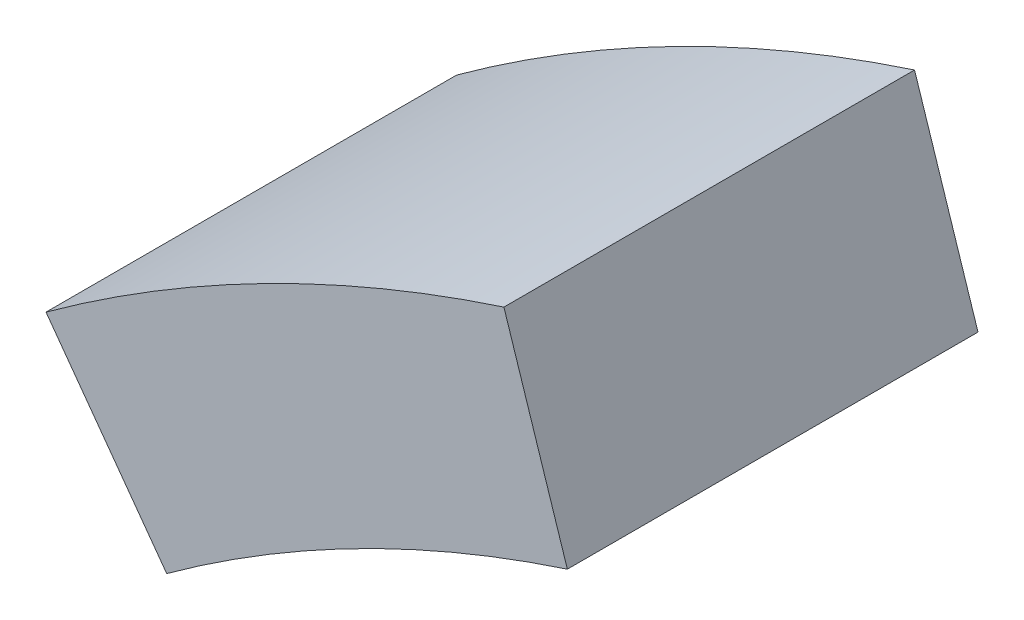
ISO-10303-21;
HEADER;
FILE_DESCRIPTION(('STEP AP214'),'2;1');
FILE_NAME('part.step','',(''),(''),'','','');
FILE_SCHEMA(('AUTOMOTIVE_DESIGN { 1 0 10303 214 1 1 1 1 }'));
ENDSEC;
DATA;
#1=APPLICATION_CONTEXT('core data for automotive mechanical design processes');
#2=APPLICATION_PROTOCOL_DEFINITION('international standard','automotive_design',2000,#1);
#3=PRODUCT_CONTEXT('',#1,'mechanical');
#4=PRODUCT('Part','Part','',(#3));
#5=PRODUCT_RELATED_PRODUCT_CATEGORY('part','',(#4));
#6=PRODUCT_DEFINITION_FORMATION('','',#4);
#7=PRODUCT_DEFINITION_CONTEXT('part definition',#1,'design');
#8=PRODUCT_DEFINITION('design','',#6,#7);
#9=PRODUCT_DEFINITION_SHAPE('','',#8);
#10=(LENGTH_UNIT() NAMED_UNIT(*) SI_UNIT(.MILLI.,.METRE.));
#11=(NAMED_UNIT(*) PLANE_ANGLE_UNIT() SI_UNIT($,.RADIAN.));
#12=(NAMED_UNIT(*) SI_UNIT($,.STERADIAN.) SOLID_ANGLE_UNIT());
#13=UNCERTAINTY_MEASURE_WITH_UNIT(LENGTH_MEASURE(1.E-05),#10,'distance_accuracy_value','');
#14=(GEOMETRIC_REPRESENTATION_CONTEXT(3) GLOBAL_UNCERTAINTY_ASSIGNED_CONTEXT((#13)) GLOBAL_UNIT_ASSIGNED_CONTEXT((#10,
#11,#12)) REPRESENTATION_CONTEXT('',''));
#15=CARTESIAN_POINT('',(0.,0.,0.));
#16=DIRECTION('',(0.,0.,1.));
#17=DIRECTION('',(1.,0.,0.));
#18=AXIS2_PLACEMENT_3D('',#15,#16,#17);
#19=CARTESIAN_POINT('',(-5870.2609394628,-1907.36340125813,624.));
#20=DIRECTION('',(-0.951056516295155,-0.309016994374945,0.));
#21=DIRECTION('',(0.309016994374945,-0.951056516295155,0.));
#22=AXIS2_PLACEMENT_3D('',#19,#20,#21);
#23=PLANE('',#22);
#24=DIRECTION('',(-0.309016994374945,0.951056516295154,0.));
#25=VECTOR('',#24,1.);
#26=CARTESIAN_POINT('',(-5870.2609394628,-1907.36340125813,0.));
#27=LINE('',#26,#25);
#28=CARTESIAN_POINT('',(-8786.89311571488,7069.10743158862,0.));
#29=VERTEX_POINT('',#28);
#30=CARTESIAN_POINT('',(-8883.30641795986,7365.83706467271,0.));
#31=VERTEX_POINT('',#30);
#32=EDGE_CURVE('E102',#29,#31,#27,.T.);
#33=ORIENTED_EDGE('',*,*,#32,.T.);
#34=DIRECTION('',(0.,0.,-1.));
#35=VECTOR('',#34,1.);
#36=CARTESIAN_POINT('',(-8883.30641795986,7365.83706467271,624.));
#37=LINE('',#36,#35);
#38=CARTESIAN_POINT('',(-8883.30641795986,7365.83706467271,624.));
#39=VERTEX_POINT('',#38);
#40=EDGE_CURVE('E11',#39,#31,#37,.T.);
#41=ORIENTED_EDGE('',*,*,#40,.F.);
#42=DIRECTION('',(-0.309016994374945,0.951056516295154,0.));
#43=VECTOR('',#42,1.);
#44=CARTESIAN_POINT('',(-5870.2609394628,-1907.36340125813,624.));
#45=LINE('',#44,#43);
#46=CARTESIAN_POINT('',(-8786.89311571488,7069.10743158862,624.));
#47=VERTEX_POINT('',#46);
#48=EDGE_CURVE('E88',#47,#39,#45,.T.);
#49=ORIENTED_EDGE('',*,*,#48,.F.);
#50=DIRECTION('',(0.,0.,-1.));
#51=VECTOR('',#50,1.);
#52=CARTESIAN_POINT('',(-8786.89311571488,7069.10743158862,624.));
#53=LINE('',#52,#51);
#54=EDGE_CURVE('E55',#47,#29,#53,.T.);
#55=ORIENTED_EDGE('',*,*,#54,.T.);
#56=EDGE_LOOP('',(#33,#41,#49,#55));
#57=FACE_BOUND('',#56,.T.);
#58=ADVANCED_FACE('F39',(#57),#23,.F.);
#59=CARTESIAN_POINT('',(-8112.,4992.,624.));
#60=DIRECTION('',(0.,0.,-1.));
#61=DIRECTION('',(-1.,0.,0.));
#62=AXIS2_PLACEMENT_3D('',#59,#60,#61);
#63=CYLINDRICAL_SURFACE('',#62,2496.);
#64=CARTESIAN_POINT('',(-8112.,4992.,0.));
#65=DIRECTION('',(0.,0.,1.));
#66=DIRECTION('',(1.,0.,0.));
#67=AXIS2_PLACEMENT_3D('',#64,#65,#66);
#68=CIRCLE('',#67,2496.);
#69=CARTESIAN_POINT('',(-9579.11198972201,7011.30641795987,0.));
#70=VERTEX_POINT('',#69);
#71=EDGE_CURVE('E93',#31,#70,#68,.T.);
#72=ORIENTED_EDGE('',*,*,#71,.T.);
#73=DIRECTION('',(0.,0.,-1.));
#74=VECTOR('',#73,1.);
#75=CARTESIAN_POINT('',(-9579.11198972201,7011.30641795987,624.));
#76=LINE('',#75,#74);
#77=CARTESIAN_POINT('',(-9579.11198972201,7011.30641795987,624.));
#78=VERTEX_POINT('',#77);
#79=EDGE_CURVE('E47',#78,#70,#76,.T.);
#80=ORIENTED_EDGE('',*,*,#79,.F.);
#81=CARTESIAN_POINT('',(-8112.,4992.,624.));
#82=DIRECTION('',(0.,0.,1.));
#83=DIRECTION('',(1.,0.,0.));
#84=AXIS2_PLACEMENT_3D('',#81,#82,#83);
#85=CIRCLE('',#84,2496.);
#86=EDGE_CURVE('E80',#39,#78,#85,.T.);
#87=ORIENTED_EDGE('',*,*,#86,.F.);
#88=ORIENTED_EDGE('',*,*,#40,.T.);
#89=EDGE_LOOP('',(#72,#80,#87,#88));
#90=FACE_BOUND('',#89,.T.);
#91=ADVANCED_FACE('F92',(#90),#63,.T.);
#92=CARTESIAN_POINT('',(-2935.53586451216,-2132.79164805303,624.));
#93=DIRECTION('',(-0.809016994374951,-0.587785252292468,0.));
#94=DIRECTION('',(0.587785252292468,-0.809016994374951,0.));
#95=AXIS2_PLACEMENT_3D('',#92,#93,#94);
#96=PLANE('',#95);
#97=DIRECTION('',(-0.587785252292468,0.809016994374951,0.));
#98=VECTOR('',#97,1.);
#99=CARTESIAN_POINT('',(-2935.53586451216,-2132.79164805303,0.));
#100=LINE('',#99,#98);
#101=CARTESIAN_POINT('',(-9395.72299100676,6758.89311571489,0.));
#102=VERTEX_POINT('',#101);
#103=EDGE_CURVE('E105',#102,#70,#100,.T.);
#104=ORIENTED_EDGE('',*,*,#103,.F.);
#105=DIRECTION('',(0.,0.,-1.));
#106=VECTOR('',#105,1.);
#107=CARTESIAN_POINT('',(-9395.72299100676,6758.89311571489,624.));
#108=LINE('',#107,#106);
#109=CARTESIAN_POINT('',(-9395.72299100676,6758.89311571489,624.));
#110=VERTEX_POINT('',#109);
#111=EDGE_CURVE('E69',#110,#102,#108,.T.);
#112=ORIENTED_EDGE('',*,*,#111,.F.);
#113=DIRECTION('',(-0.587785252292468,0.809016994374951,0.));
#114=VECTOR('',#113,1.);
#115=CARTESIAN_POINT('',(-2935.53586451216,-2132.79164805303,624.));
#116=LINE('',#115,#114);
#117=EDGE_CURVE('E87',#110,#78,#116,.T.);
#118=ORIENTED_EDGE('',*,*,#117,.T.);
#119=ORIENTED_EDGE('',*,*,#79,.T.);
#120=EDGE_LOOP('',(#104,#112,#118,#119));
#121=FACE_BOUND('',#120,.T.);
#122=ADVANCED_FACE('F96',(#121),#96,.T.);
#123=CARTESIAN_POINT('',(-8112.,4992.,624.));
#124=DIRECTION('',(0.,0.,-1.));
#125=DIRECTION('',(-1.,0.,0.));
#126=AXIS2_PLACEMENT_3D('',#123,#124,#125);
#127=CYLINDRICAL_SURFACE('',#126,2184.);
#128=CARTESIAN_POINT('',(-8112.,4992.,0.));
#129=DIRECTION('',(0.,0.,1.));
#130=DIRECTION('',(1.,0.,0.));
#131=AXIS2_PLACEMENT_3D('',#128,#129,#130);
#132=CIRCLE('',#131,2184.);
#133=EDGE_CURVE('E107',#29,#102,#132,.T.);
#134=ORIENTED_EDGE('',*,*,#133,.F.);
#135=ORIENTED_EDGE('',*,*,#54,.F.);
#136=CARTESIAN_POINT('',(-8112.,4992.,624.));
#137=DIRECTION('',(0.,0.,1.));
#138=DIRECTION('',(1.,0.,0.));
#139=AXIS2_PLACEMENT_3D('',#136,#137,#138);
#140=CIRCLE('',#139,2184.);
#141=EDGE_CURVE('E97',#47,#110,#140,.T.);
#142=ORIENTED_EDGE('',*,*,#141,.T.);
#143=ORIENTED_EDGE('',*,*,#111,.T.);
#144=EDGE_LOOP('',(#134,#135,#142,#143));
#145=FACE_BOUND('',#144,.T.);
#146=ADVANCED_FACE('F113',(#145),#127,.F.);
#147=CARTESIAN_POINT('',(0.,0.,624.));
#148=DIRECTION('',(0.,0.,1.));
#149=DIRECTION('',(1.,0.,0.));
#150=AXIS2_PLACEMENT_3D('',#147,#148,#149);
#151=PLANE('',#150);
#152=ORIENTED_EDGE('',*,*,#48,.T.);
#153=ORIENTED_EDGE('',*,*,#86,.T.);
#154=ORIENTED_EDGE('',*,*,#117,.F.);
#155=ORIENTED_EDGE('',*,*,#141,.F.);
#156=EDGE_LOOP('',(#152,#153,#154,#155));
#157=FACE_BOUND('',#156,.T.);
#158=ADVANCED_FACE('F84',(#157),#151,.T.);
#159=CARTESIAN_POINT('',(0.,0.,0.));
#160=DIRECTION('',(0.,0.,1.));
#161=DIRECTION('',(1.,0.,0.));
#162=AXIS2_PLACEMENT_3D('',#159,#160,#161);
#163=PLANE('',#162);
#164=ORIENTED_EDGE('',*,*,#32,.F.);
#165=ORIENTED_EDGE('',*,*,#133,.T.);
#166=ORIENTED_EDGE('',*,*,#103,.T.);
#167=ORIENTED_EDGE('',*,*,#71,.F.);
#168=EDGE_LOOP('',(#164,#165,#166,#167));
#169=FACE_BOUND('',#168,.T.);
#170=ADVANCED_FACE('F112',(#169),#163,.F.);
#171=CLOSED_SHELL('',(#58,#91,#122,#146,#158,#170));
#172=MANIFOLD_SOLID_BREP('B2',#171);
#173=ADVANCED_BREP_SHAPE_REPRESENTATION('',(#18,#172),#14);
#174=SHAPE_DEFINITION_REPRESENTATION(#9,#173);
ENDSEC;
END-ISO-10303-21;
